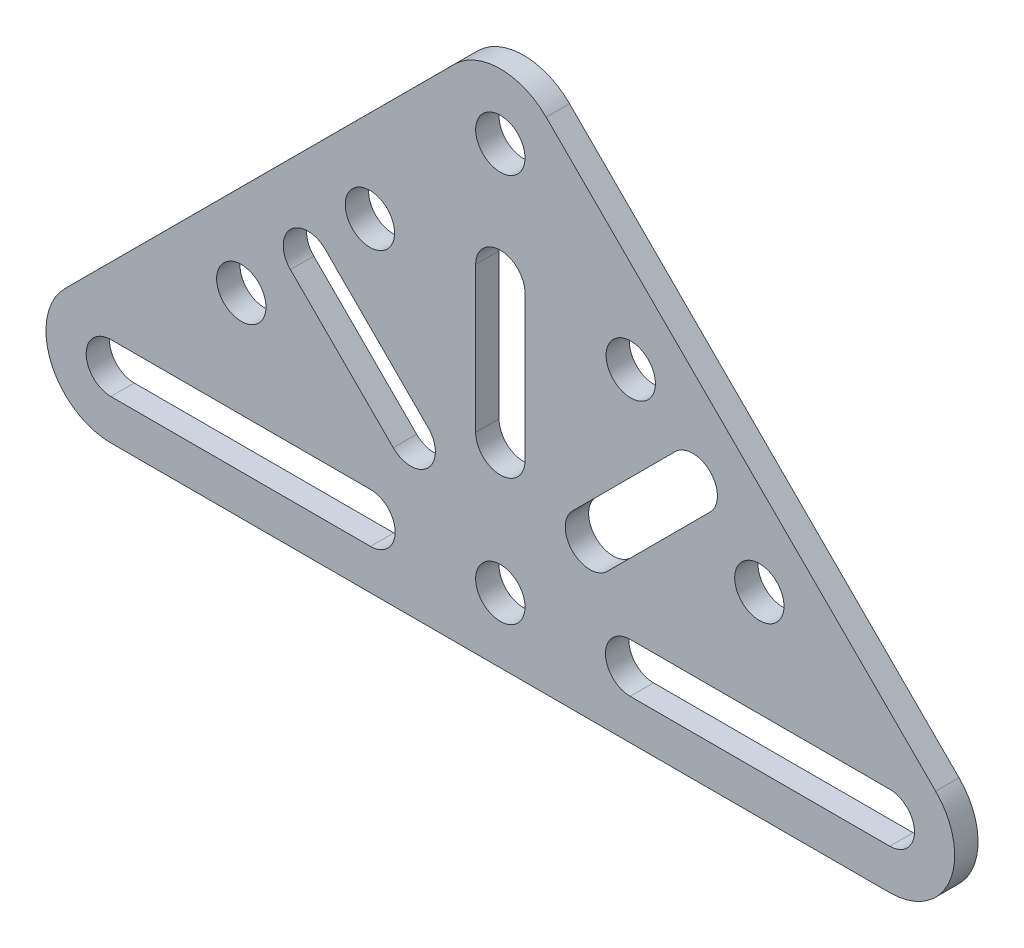
ISO-10303-21;
HEADER;
FILE_DESCRIPTION(('STEP AP214'),'2;1');
FILE_NAME('part.step','',(''),(''),'','','');
FILE_SCHEMA(('AUTOMOTIVE_DESIGN { 1 0 10303 214 1 1 1 1 }'));
ENDSEC;
DATA;
#1=APPLICATION_CONTEXT('core data for automotive mechanical design processes');
#2=APPLICATION_PROTOCOL_DEFINITION('international standard','automotive_design',2000,#1);
#3=PRODUCT_CONTEXT('',#1,'mechanical');
#4=PRODUCT('Part','Part','',(#3));
#5=PRODUCT_RELATED_PRODUCT_CATEGORY('part','',(#4));
#6=PRODUCT_DEFINITION_FORMATION('','',#4);
#7=PRODUCT_DEFINITION_CONTEXT('part definition',#1,'design');
#8=PRODUCT_DEFINITION('design','',#6,#7);
#9=PRODUCT_DEFINITION_SHAPE('','',#8);
#10=(LENGTH_UNIT() NAMED_UNIT(*) SI_UNIT(.MILLI.,.METRE.));
#11=(NAMED_UNIT(*) PLANE_ANGLE_UNIT() SI_UNIT($,.RADIAN.));
#12=(NAMED_UNIT(*) SI_UNIT($,.STERADIAN.) SOLID_ANGLE_UNIT());
#13=UNCERTAINTY_MEASURE_WITH_UNIT(LENGTH_MEASURE(1.E-05),#10,'distance_accuracy_value','');
#14=(GEOMETRIC_REPRESENTATION_CONTEXT(3) GLOBAL_UNCERTAINTY_ASSIGNED_CONTEXT((#13)) GLOBAL_UNIT_ASSIGNED_CONTEXT((#10,
#11,#12)) REPRESENTATION_CONTEXT('',''));
#15=CARTESIAN_POINT('',(0.,0.,0.));
#16=DIRECTION('',(0.,0.,1.));
#17=DIRECTION('',(1.,0.,0.));
#18=AXIS2_PLACEMENT_3D('',#15,#16,#17);
#19=CARTESIAN_POINT('',(38.1,0.,2.286));
#20=DIRECTION('',(0.,0.,-1.));
#21=DIRECTION('',(-1.,0.,0.));
#22=AXIS2_PLACEMENT_3D('',#19,#20,#21);
#23=CYLINDRICAL_SURFACE('',#22,6.35);
#24=CARTESIAN_POINT('',(38.1,0.,0.));
#25=DIRECTION('',(0.,0.,1.));
#26=DIRECTION('',(-1.,0.,0.));
#27=AXIS2_PLACEMENT_3D('',#24,#25,#26);
#28=CIRCLE('',#27,6.35);
#29=CARTESIAN_POINT('',(38.0999999999998,-6.35000000000001,0.));
#30=VERTEX_POINT('',#29);
#31=CARTESIAN_POINT('',(42.5873298500313,4.49292452830199,0.));
#32=VERTEX_POINT('',#31);
#33=EDGE_CURVE('E406',#30,#32,#28,.T.);
#34=ORIENTED_EDGE('',*,*,#33,.T.);
#35=DIRECTION('',(0.,0.,-1.));
#36=VECTOR('',#35,1.);
#37=CARTESIAN_POINT('',(42.5873298500313,4.49292452830199,2.286));
#38=LINE('',#37,#36);
#39=CARTESIAN_POINT('',(42.5873298500313,4.49292452830199,2.286));
#40=VERTEX_POINT('',#39);
#41=EDGE_CURVE('E11',#40,#32,#38,.T.);
#42=ORIENTED_EDGE('',*,*,#41,.F.);
#43=CARTESIAN_POINT('',(38.1,0.,2.286));
#44=DIRECTION('',(0.,0.,1.));
#45=DIRECTION('',(-1.,0.,0.));
#46=AXIS2_PLACEMENT_3D('',#43,#44,#45);
#47=CIRCLE('',#46,6.35);
#48=CARTESIAN_POINT('',(38.0999999999998,-6.35000000000001,2.286));
#49=VERTEX_POINT('',#48);
#50=EDGE_CURVE('E409',#49,#40,#47,.T.);
#51=ORIENTED_EDGE('',*,*,#50,.F.);
#52=DIRECTION('',(0.,0.,-1.));
#53=VECTOR('',#52,1.);
#54=CARTESIAN_POINT('',(38.0999999999998,-6.35000000000001,2.286));
#55=LINE('',#54,#53);
#56=EDGE_CURVE('E423',#49,#30,#55,.T.);
#57=ORIENTED_EDGE('',*,*,#56,.T.);
#58=EDGE_LOOP('',(#34,#42,#51,#57));
#59=FACE_BOUND('',#58,.T.);
#60=ADVANCED_FACE('F36',(#59),#23,.T.);
#61=CARTESIAN_POINT('',(42.5873298500313,4.49292452830199,2.286));
#62=DIRECTION('',(-0.706666118115189,-0.707547169811321,0.));
#63=DIRECTION('',(0.707547169811321,-0.706666118115189,0.));
#64=AXIS2_PLACEMENT_3D('',#61,#62,#63);
#65=PLANE('',#64);
#66=DIRECTION('',(-0.707547169811321,0.706666118115189,0.));
#67=VECTOR('',#66,1.);
#68=CARTESIAN_POINT('',(42.5873298500313,4.49292452830199,0.));
#69=LINE('',#68,#67);
#70=CARTESIAN_POINT('',(4.48732985003148,42.5454816565685,0.));
#71=VERTEX_POINT('',#70);
#72=EDGE_CURVE('E426',#32,#71,#69,.T.);
#73=ORIENTED_EDGE('',*,*,#72,.T.);
#74=DIRECTION('',(0.,0.,-1.));
#75=VECTOR('',#74,1.);
#76=CARTESIAN_POINT('',(4.48732985003148,42.5454816565685,2.286));
#77=LINE('',#76,#75);
#78=CARTESIAN_POINT('',(4.48732985003148,42.5454816565685,2.286));
#79=VERTEX_POINT('',#78);
#80=EDGE_CURVE('E43',#79,#71,#77,.T.);
#81=ORIENTED_EDGE('',*,*,#80,.F.);
#82=DIRECTION('',(-0.707547169811321,0.706666118115189,0.));
#83=VECTOR('',#82,1.);
#84=CARTESIAN_POINT('',(42.5873298500313,4.49292452830199,2.286));
#85=LINE('',#84,#83);
#86=EDGE_CURVE('E412',#40,#79,#85,.T.);
#87=ORIENTED_EDGE('',*,*,#86,.F.);
#88=ORIENTED_EDGE('',*,*,#41,.T.);
#89=EDGE_LOOP('',(#73,#81,#87,#88));
#90=FACE_BOUND('',#89,.T.);
#91=ADVANCED_FACE('F472',(#90),#65,.F.);
#92=CARTESIAN_POINT('',(0.,38.0525571282667,2.286));
#93=DIRECTION('',(0.,0.,-1.));
#94=DIRECTION('',(-1.,0.,0.));
#95=AXIS2_PLACEMENT_3D('',#92,#93,#94);
#96=CYLINDRICAL_SURFACE('',#95,6.35);
#97=CARTESIAN_POINT('',(0.,38.0525571282667,0.));
#98=DIRECTION('',(0.,0.,1.));
#99=DIRECTION('',(-1.,0.,0.));
#100=AXIS2_PLACEMENT_3D('',#97,#98,#99);
#101=CIRCLE('',#100,6.35);
#102=CARTESIAN_POINT('',(-4.48732985003148,42.5454816565685,0.));
#103=VERTEX_POINT('',#102);
#104=EDGE_CURVE('E428',#71,#103,#101,.T.);
#105=ORIENTED_EDGE('',*,*,#104,.T.);
#106=DIRECTION('',(0.,0.,-1.));
#107=VECTOR('',#106,1.);
#108=CARTESIAN_POINT('',(-4.48732985003148,42.5454816565685,2.286));
#109=LINE('',#108,#107);
#110=CARTESIAN_POINT('',(-4.48732985003148,42.5454816565685,2.286));
#111=VERTEX_POINT('',#110);
#112=EDGE_CURVE('E443',#111,#103,#109,.T.);
#113=ORIENTED_EDGE('',*,*,#112,.F.);
#114=CARTESIAN_POINT('',(0.,38.0525571282667,2.286));
#115=DIRECTION('',(0.,0.,1.));
#116=DIRECTION('',(-1.,0.,0.));
#117=AXIS2_PLACEMENT_3D('',#114,#115,#116);
#118=CIRCLE('',#117,6.35);
#119=EDGE_CURVE('E415',#79,#111,#118,.T.);
#120=ORIENTED_EDGE('',*,*,#119,.F.);
#121=ORIENTED_EDGE('',*,*,#80,.T.);
#122=EDGE_LOOP('',(#105,#113,#120,#121));
#123=FACE_BOUND('',#122,.T.);
#124=ADVANCED_FACE('F450',(#123),#96,.T.);
#125=CARTESIAN_POINT('',(-42.5873298500313,4.49292452830199,2.286));
#126=DIRECTION('',(0.706666118115189,-0.707547169811321,0.));
#127=DIRECTION('',(0.707547169811321,0.706666118115189,0.));
#128=AXIS2_PLACEMENT_3D('',#125,#126,#127);
#129=PLANE('',#128);
#130=DIRECTION('',(-0.707547169811321,-0.706666118115189,0.));
#131=VECTOR('',#130,1.);
#132=CARTESIAN_POINT('',(-42.5873298500313,4.49292452830199,0.));
#133=LINE('',#132,#131);
#134=CARTESIAN_POINT('',(-42.5873298500313,4.49292452830199,0.));
#135=VERTEX_POINT('',#134);
#136=EDGE_CURVE('E430',#103,#135,#133,.T.);
#137=ORIENTED_EDGE('',*,*,#136,.T.);
#138=DIRECTION('',(0.,0.,-1.));
#139=VECTOR('',#138,1.);
#140=CARTESIAN_POINT('',(-42.5873298500313,4.49292452830199,2.286));
#141=LINE('',#140,#139);
#142=CARTESIAN_POINT('',(-42.5873298500313,4.49292452830199,2.286));
#143=VERTEX_POINT('',#142);
#144=EDGE_CURVE('E440',#143,#135,#141,.T.);
#145=ORIENTED_EDGE('',*,*,#144,.F.);
#146=DIRECTION('',(-0.707547169811321,-0.706666118115189,0.));
#147=VECTOR('',#146,1.);
#148=CARTESIAN_POINT('',(-42.5873298500313,4.49292452830199,2.286));
#149=LINE('',#148,#147);
#150=EDGE_CURVE('E417',#111,#143,#149,.T.);
#151=ORIENTED_EDGE('',*,*,#150,.F.);
#152=ORIENTED_EDGE('',*,*,#112,.T.);
#153=EDGE_LOOP('',(#137,#145,#151,#152));
#154=FACE_BOUND('',#153,.T.);
#155=ADVANCED_FACE('F460',(#154),#129,.F.);
#156=CARTESIAN_POINT('',(-38.1,0.,2.286));
#157=DIRECTION('',(0.,0.,-1.));
#158=DIRECTION('',(-1.,0.,0.));
#159=AXIS2_PLACEMENT_3D('',#156,#157,#158);
#160=CYLINDRICAL_SURFACE('',#159,6.35);
#161=CARTESIAN_POINT('',(-38.1,0.,0.));
#162=DIRECTION('',(0.,0.,1.));
#163=DIRECTION('',(1.,0.,0.));
#164=AXIS2_PLACEMENT_3D('',#161,#162,#163);
#165=CIRCLE('',#164,6.35);
#166=CARTESIAN_POINT('',(-38.0999999999999,-6.35000000000001,0.));
#167=VERTEX_POINT('',#166);
#168=EDGE_CURVE('E432',#135,#167,#165,.T.);
#169=ORIENTED_EDGE('',*,*,#168,.T.);
#170=DIRECTION('',(0.,0.,-1.));
#171=VECTOR('',#170,1.);
#172=CARTESIAN_POINT('',(-38.0999999999999,-6.35000000000001,2.286));
#173=LINE('',#172,#171);
#174=CARTESIAN_POINT('',(-38.0999999999999,-6.35000000000001,2.286));
#175=VERTEX_POINT('',#174);
#176=EDGE_CURVE('E437',#175,#167,#173,.T.);
#177=ORIENTED_EDGE('',*,*,#176,.F.);
#178=CARTESIAN_POINT('',(-38.1,0.,2.286));
#179=DIRECTION('',(0.,0.,1.));
#180=DIRECTION('',(1.,0.,0.));
#181=AXIS2_PLACEMENT_3D('',#178,#179,#180);
#182=CIRCLE('',#181,6.35);
#183=EDGE_CURVE('E419',#143,#175,#182,.T.);
#184=ORIENTED_EDGE('',*,*,#183,.F.);
#185=ORIENTED_EDGE('',*,*,#144,.T.);
#186=EDGE_LOOP('',(#169,#177,#184,#185));
#187=FACE_BOUND('',#186,.T.);
#188=ADVANCED_FACE('F464',(#187),#160,.T.);
#189=CARTESIAN_POINT('',(38.0999999999998,-6.35000000000001,2.286));
#190=DIRECTION('',(0.,1.,0.));
#191=DIRECTION('',(-1.,0.,0.));
#192=AXIS2_PLACEMENT_3D('',#189,#190,#191);
#193=PLANE('',#192);
#194=DIRECTION('',(1.,0.,0.));
#195=VECTOR('',#194,1.);
#196=CARTESIAN_POINT('',(38.0999999999998,-6.35000000000001,0.));
#197=LINE('',#196,#195);
#198=EDGE_CURVE('E413',#167,#30,#197,.T.);
#199=ORIENTED_EDGE('',*,*,#198,.T.);
#200=ORIENTED_EDGE('',*,*,#56,.F.);
#201=DIRECTION('',(1.,0.,0.));
#202=VECTOR('',#201,1.);
#203=CARTESIAN_POINT('',(38.0999999999998,-6.35000000000001,2.286));
#204=LINE('',#203,#202);
#205=EDGE_CURVE('E421',#175,#49,#204,.T.);
#206=ORIENTED_EDGE('',*,*,#205,.F.);
#207=ORIENTED_EDGE('',*,*,#176,.T.);
#208=EDGE_LOOP('',(#199,#200,#206,#207));
#209=FACE_BOUND('',#208,.T.);
#210=ADVANCED_FACE('F475',(#209),#193,.F.);
#211=CARTESIAN_POINT('',(38.1,0.,2.286));
#212=DIRECTION('',(0.,0.,-1.));
#213=DIRECTION('',(-1.,0.,0.));
#214=AXIS2_PLACEMENT_3D('',#211,#212,#213);
#215=PLANE('',#214);
#216=DIRECTION('',(-0.70710678118655,-0.707106781186545,0.));
#217=VECTOR('',#216,1.);
#218=CARTESIAN_POINT('',(17.1188269258908,20.531324251897,2.286));
#219=LINE('',#218,#217);
#220=CARTESIAN_POINT('',(17.1188269258908,20.531324251897,2.286));
#221=VERTEX_POINT('',#220);
#222=CARTESIAN_POINT('',(7.06094007029334,10.4734373962996,2.286));
#223=VERTEX_POINT('',#222);
#224=EDGE_CURVE('E235',#221,#223,#219,.T.);
#225=ORIENTED_EDGE('',*,*,#224,.F.);
#226=CARTESIAN_POINT('',(18.8250755888939,18.8250755888939,2.286));
#227=DIRECTION('',(0.,0.,1.));
#228=DIRECTION('',(0.,-1.,0.));
#229=AXIS2_PLACEMENT_3D('',#226,#227,#228);
#230=CIRCLE('',#229,2.41299999999999);
#231=CARTESIAN_POINT('',(20.5313242518971,17.1188269258907,2.286));
#232=VERTEX_POINT('',#231);
#233=EDGE_CURVE('E50',#232,#221,#230,.T.);
#234=ORIENTED_EDGE('',*,*,#233,.F.);
#235=DIRECTION('',(0.70710678118655,0.707106781186545,0.));
#236=VECTOR('',#235,1.);
#237=CARTESIAN_POINT('',(20.5313242518971,17.1188269258907,2.286));
#238=LINE('',#237,#236);
#239=CARTESIAN_POINT('',(10.4734373962996,7.06094007029327,2.286));
#240=VERTEX_POINT('',#239);
#241=EDGE_CURVE('E226',#240,#232,#238,.T.);
#242=ORIENTED_EDGE('',*,*,#241,.F.);
#243=CARTESIAN_POINT('',(8.76718873329647,8.76718873329641,2.286));
#244=DIRECTION('',(0.,0.,1.));
#245=DIRECTION('',(0.,-1.,0.));
#246=AXIS2_PLACEMENT_3D('',#243,#244,#245);
#247=CIRCLE('',#246,2.413);
#248=EDGE_CURVE('E229',#223,#240,#247,.T.);
#249=ORIENTED_EDGE('',*,*,#248,.F.);
#250=EDGE_LOOP('',(#225,#234,#242,#249));
#251=FACE_BOUND('',#250,.T.);
#252=DIRECTION('',(0.,-1.,0.));
#253=VECTOR('',#252,1.);
#254=CARTESIAN_POINT('',(-2.41299999999995,26.6226772105124,2.286));
#255=LINE('',#254,#253);
#256=CARTESIAN_POINT('',(-2.41299999999995,26.6226772105124,2.286));
#257=VERTEX_POINT('',#256);
#258=CARTESIAN_POINT('',(-2.41299999999998,12.3986772105124,2.286));
#259=VERTEX_POINT('',#258);
#260=EDGE_CURVE('E260',#257,#259,#255,.T.);
#261=ORIENTED_EDGE('',*,*,#260,.F.);
#262=CARTESIAN_POINT('',(0.,26.6226772105124,2.286));
#263=DIRECTION('',(0.,0.,1.));
#264=DIRECTION('',(0.707106781186546,-0.707106781186549,0.));
#265=AXIS2_PLACEMENT_3D('',#262,#263,#264);
#266=CIRCLE('',#265,2.41299999999999);
#267=CARTESIAN_POINT('',(2.41300000000004,26.6226772105124,2.286));
#268=VERTEX_POINT('',#267);
#269=EDGE_CURVE('E241',#268,#257,#266,.T.);
#270=ORIENTED_EDGE('',*,*,#269,.F.);
#271=DIRECTION('',(0.,1.,0.));
#272=VECTOR('',#271,1.);
#273=CARTESIAN_POINT('',(2.41300000000004,26.6226772105124,2.286));
#274=LINE('',#273,#272);
#275=CARTESIAN_POINT('',(2.41300000000002,12.3986772105124,2.286));
#276=VERTEX_POINT('',#275);
#277=EDGE_CURVE('E249',#276,#268,#274,.T.);
#278=ORIENTED_EDGE('',*,*,#277,.F.);
#279=CARTESIAN_POINT('',(0.,12.3986772105124,2.286));
#280=DIRECTION('',(0.,0.,1.));
#281=DIRECTION('',(0.707106781186546,-0.707106781186549,0.));
#282=AXIS2_PLACEMENT_3D('',#279,#280,#281);
#283=CIRCLE('',#282,2.413);
#284=EDGE_CURVE('E263',#259,#276,#283,.T.);
#285=ORIENTED_EDGE('',*,*,#284,.F.);
#286=EDGE_LOOP('',(#261,#270,#278,#285));
#287=FACE_BOUND('',#286,.T.);
#288=DIRECTION('',(0.707106781186547,-0.707106781186548,0.));
#289=VECTOR('',#288,1.);
#290=CARTESIAN_POINT('',(-20.531324251897,17.1188269258908,2.286));
#291=LINE('',#290,#289);
#292=CARTESIAN_POINT('',(-20.531324251897,17.1188269258908,2.286));
#293=VERTEX_POINT('',#292);
#294=CARTESIAN_POINT('',(-10.4734373962996,7.0609400702933,2.286));
#295=VERTEX_POINT('',#294);
#296=EDGE_CURVE('E292',#293,#295,#291,.T.);
#297=ORIENTED_EDGE('',*,*,#296,.F.);
#298=CARTESIAN_POINT('',(-18.825075588894,18.8250755888938,2.286));
#299=DIRECTION('',(0.,0.,1.));
#300=DIRECTION('',(1.,0.,0.));
#301=AXIS2_PLACEMENT_3D('',#298,#299,#300);
#302=CIRCLE('',#301,2.41299999999999);
#303=CARTESIAN_POINT('',(-17.1188269258908,20.531324251897,2.286));
#304=VERTEX_POINT('',#303);
#305=EDGE_CURVE('E270',#304,#293,#302,.T.);
#306=ORIENTED_EDGE('',*,*,#305,.F.);
#307=DIRECTION('',(-0.707106781186548,0.707106781186547,0.));
#308=VECTOR('',#307,1.);
#309=CARTESIAN_POINT('',(-17.1188269258908,20.531324251897,2.286));
#310=LINE('',#309,#308);
#311=CARTESIAN_POINT('',(-7.0609400702933,10.4734373962996,2.286));
#312=VERTEX_POINT('',#311);
#313=EDGE_CURVE('E281',#312,#304,#310,.T.);
#314=ORIENTED_EDGE('',*,*,#313,.F.);
#315=CARTESIAN_POINT('',(-8.76718873329644,8.76718873329644,2.286));
#316=DIRECTION('',(0.,0.,1.));
#317=DIRECTION('',(1.,0.,0.));
#318=AXIS2_PLACEMENT_3D('',#315,#316,#317);
#319=CIRCLE('',#318,2.413);
#320=EDGE_CURVE('E295',#295,#312,#319,.T.);
#321=ORIENTED_EDGE('',*,*,#320,.F.);
#322=EDGE_LOOP('',(#297,#306,#314,#321));
#323=FACE_BOUND('',#322,.T.);
#324=DIRECTION('',(1.,0.,0.));
#325=VECTOR('',#324,1.);
#326=CARTESIAN_POINT('',(38.1,2.413,2.286));
#327=LINE('',#326,#325);
#328=CARTESIAN_POINT('',(12.7,2.413,2.286));
#329=VERTEX_POINT('',#328);
#330=CARTESIAN_POINT('',(38.1,2.413,2.286));
#331=VERTEX_POINT('',#330);
#332=EDGE_CURVE('E327',#329,#331,#327,.T.);
#333=ORIENTED_EDGE('',*,*,#332,.T.);
#334=CARTESIAN_POINT('',(38.1,0.,2.286));
#335=DIRECTION('',(0.,0.,-1.));
#336=DIRECTION('',(-1.,0.,0.));
#337=AXIS2_PLACEMENT_3D('',#334,#335,#336);
#338=CIRCLE('',#337,2.41300000000001);
#339=CARTESIAN_POINT('',(38.1,-2.41300000000001,2.286));
#340=VERTEX_POINT('',#339);
#341=EDGE_CURVE('E335',#331,#340,#338,.T.);
#342=ORIENTED_EDGE('',*,*,#341,.T.);
#343=DIRECTION('',(-1.,0.,0.));
#344=VECTOR('',#343,1.);
#345=CARTESIAN_POINT('',(38.1,-2.41300000000001,2.286));
#346=LINE('',#345,#344);
#347=CARTESIAN_POINT('',(12.7,-2.41300000000001,2.286));
#348=VERTEX_POINT('',#347);
#349=EDGE_CURVE('E302',#340,#348,#346,.T.);
#350=ORIENTED_EDGE('',*,*,#349,.T.);
#351=CARTESIAN_POINT('',(12.7,0.,2.286));
#352=DIRECTION('',(0.,0.,-1.));
#353=DIRECTION('',(1.,0.,0.));
#354=AXIS2_PLACEMENT_3D('',#351,#352,#353);
#355=CIRCLE('',#354,2.41300000000001);
#356=EDGE_CURVE('E319',#348,#329,#355,.T.);
#357=ORIENTED_EDGE('',*,*,#356,.T.);
#358=EDGE_LOOP('',(#333,#342,#350,#357));
#359=FACE_BOUND('',#358,.T.);
#360=DIRECTION('',(1.,0.,0.));
#361=VECTOR('',#360,1.);
#362=CARTESIAN_POINT('',(-38.1,-2.41300000000001,2.286));
#363=LINE('',#362,#361);
#364=CARTESIAN_POINT('',(-38.1,-2.41300000000001,2.286));
#365=VERTEX_POINT('',#364);
#366=CARTESIAN_POINT('',(-12.7,-2.41300000000001,2.286));
#367=VERTEX_POINT('',#366);
#368=EDGE_CURVE('E356',#365,#367,#363,.T.);
#369=ORIENTED_EDGE('',*,*,#368,.F.);
#370=CARTESIAN_POINT('',(-38.1,0.,2.286));
#371=DIRECTION('',(0.,0.,1.));
#372=DIRECTION('',(1.,0.,0.));
#373=AXIS2_PLACEMENT_3D('',#370,#371,#372);
#374=CIRCLE('',#373,2.41300000000001);
#375=CARTESIAN_POINT('',(-38.1,2.413,2.286));
#376=VERTEX_POINT('',#375);
#377=EDGE_CURVE('E340',#376,#365,#374,.T.);
#378=ORIENTED_EDGE('',*,*,#377,.F.);
#379=DIRECTION('',(-1.,0.,0.));
#380=VECTOR('',#379,1.);
#381=CARTESIAN_POINT('',(-38.1,2.413,2.286));
#382=LINE('',#381,#380);
#383=CARTESIAN_POINT('',(-12.7,2.413,2.286));
#384=VERTEX_POINT('',#383);
#385=EDGE_CURVE('E345',#384,#376,#382,.T.);
#386=ORIENTED_EDGE('',*,*,#385,.F.);
#387=CARTESIAN_POINT('',(-12.7,0.,2.286));
#388=DIRECTION('',(0.,0.,1.));
#389=DIRECTION('',(-1.,0.,0.));
#390=AXIS2_PLACEMENT_3D('',#387,#388,#389);
#391=CIRCLE('',#390,2.41300000000001);
#392=EDGE_CURVE('E359',#367,#384,#391,.T.);
#393=ORIENTED_EDGE('',*,*,#392,.F.);
#394=EDGE_LOOP('',(#369,#378,#386,#393));
#395=FACE_BOUND('',#394,.T.);
#396=CARTESIAN_POINT('',(12.7599056603774,25.3085403541774,2.286));
#397=DIRECTION('',(0.,0.,1.));
#398=DIRECTION('',(-1.,0.,0.));
#399=AXIS2_PLACEMENT_3D('',#396,#397,#398);
#400=CIRCLE('',#399,2.413);
#401=CARTESIAN_POINT('',(10.3469056603774,25.3085403541774,2.286));
#402=VERTEX_POINT('',#401);
#403=EDGE_CURVE('E366',#402,#402,#400,.T.);
#404=ORIENTED_EDGE('',*,*,#403,.F.);
#405=EDGE_LOOP('',(#404));
#406=FACE_BOUND('',#405,.T.);
#407=CARTESIAN_POINT('',(-12.7599056603774,25.3085403541774,2.286));
#408=DIRECTION('',(0.,0.,1.));
#409=DIRECTION('',(1.,0.,0.));
#410=AXIS2_PLACEMENT_3D('',#407,#408,#409);
#411=CIRCLE('',#410,2.413);
#412=CARTESIAN_POINT('',(-10.3469056603774,25.3085403541774,2.286));
#413=VERTEX_POINT('',#412);
#414=EDGE_CURVE('E383',#413,#413,#411,.T.);
#415=ORIENTED_EDGE('',*,*,#414,.F.);
#416=EDGE_LOOP('',(#415));
#417=FACE_BOUND('',#416,.T.);
#418=CARTESIAN_POINT('',(25.3400943396226,12.7440167740893,2.286));
#419=DIRECTION('',(0.,0.,1.));
#420=DIRECTION('',(-1.,0.,0.));
#421=AXIS2_PLACEMENT_3D('',#418,#419,#420);
#422=CIRCLE('',#421,2.41299999999999);
#423=CARTESIAN_POINT('',(22.9270943396227,12.7440167740893,2.286));
#424=VERTEX_POINT('',#423);
#425=EDGE_CURVE('E377',#424,#424,#422,.T.);
#426=ORIENTED_EDGE('',*,*,#425,.F.);
#427=EDGE_LOOP('',(#426));
#428=FACE_BOUND('',#427,.T.);
#429=CARTESIAN_POINT('',(-25.3400943396226,12.7440167740893,2.286));
#430=DIRECTION('',(0.,0.,1.));
#431=DIRECTION('',(1.,0.,0.));
#432=AXIS2_PLACEMENT_3D('',#429,#430,#431);
#433=CIRCLE('',#432,2.413);
#434=CARTESIAN_POINT('',(-22.9270943396226,12.7440167740893,2.286));
#435=VERTEX_POINT('',#434);
#436=EDGE_CURVE('E376',#435,#435,#433,.T.);
#437=ORIENTED_EDGE('',*,*,#436,.F.);
#438=EDGE_LOOP('',(#437));
#439=FACE_BOUND('',#438,.T.);
#440=CARTESIAN_POINT('',(0.,38.0525571282667,2.286));
#441=DIRECTION('',(0.,0.,1.));
#442=DIRECTION('',(1.,0.,0.));
#443=AXIS2_PLACEMENT_3D('',#440,#441,#442);
#444=CIRCLE('',#443,2.413);
#445=CARTESIAN_POINT('',(2.413,38.0525571282667,2.286));
#446=VERTEX_POINT('',#445);
#447=EDGE_CURVE('E395',#446,#446,#444,.T.);
#448=ORIENTED_EDGE('',*,*,#447,.F.);
#449=EDGE_LOOP('',(#448));
#450=FACE_BOUND('',#449,.T.);
#451=CARTESIAN_POINT('',(0.,0.,2.286));
#452=DIRECTION('',(0.,0.,1.));
#453=DIRECTION('',(1.,0.,0.));
#454=AXIS2_PLACEMENT_3D('',#451,#452,#453);
#455=CIRCLE('',#454,2.413);
#456=CARTESIAN_POINT('',(2.413,0.,2.286));
#457=VERTEX_POINT('',#456);
#458=EDGE_CURVE('E394',#457,#457,#455,.T.);
#459=ORIENTED_EDGE('',*,*,#458,.F.);
#460=EDGE_LOOP('',(#459));
#461=FACE_BOUND('',#460,.T.);
#462=ORIENTED_EDGE('',*,*,#50,.T.);
#463=ORIENTED_EDGE('',*,*,#86,.T.);
#464=ORIENTED_EDGE('',*,*,#119,.T.);
#465=ORIENTED_EDGE('',*,*,#150,.T.);
#466=ORIENTED_EDGE('',*,*,#183,.T.);
#467=ORIENTED_EDGE('',*,*,#205,.T.);
#468=EDGE_LOOP('',(#462,#463,#464,#465,#466,#467));
#469=FACE_BOUND('',#468,.T.);
#470=ADVANCED_FACE('F468',(#251,#287,#323,#359,#395,#406,#417,#428,#439,#450,#461,#469),#215,.F.);
#471=CARTESIAN_POINT('',(38.1,0.,0.));
#472=DIRECTION('',(0.,0.,-1.));
#473=DIRECTION('',(-1.,0.,0.));
#474=AXIS2_PLACEMENT_3D('',#471,#472,#473);
#475=PLANE('',#474);
#476=CARTESIAN_POINT('',(18.8250755888939,18.8250755888939,0.));
#477=DIRECTION('',(0.,0.,1.));
#478=DIRECTION('',(0.,-1.,0.));
#479=AXIS2_PLACEMENT_3D('',#476,#477,#478);
#480=CIRCLE('',#479,2.41299999999999);
#481=CARTESIAN_POINT('',(20.5313242518971,17.1188269258907,0.));
#482=VERTEX_POINT('',#481);
#483=CARTESIAN_POINT('',(17.1188269258908,20.531324251897,0.));
#484=VERTEX_POINT('',#483);
#485=EDGE_CURVE('E210',#482,#484,#480,.T.);
#486=ORIENTED_EDGE('',*,*,#485,.T.);
#487=DIRECTION('',(-0.70710678118655,-0.707106781186545,0.));
#488=VECTOR('',#487,1.);
#489=CARTESIAN_POINT('',(17.1188269258908,20.531324251897,0.));
#490=LINE('',#489,#488);
#491=CARTESIAN_POINT('',(7.06094007029334,10.4734373962996,0.));
#492=VERTEX_POINT('',#491);
#493=EDGE_CURVE('E219',#484,#492,#490,.T.);
#494=ORIENTED_EDGE('',*,*,#493,.T.);
#495=CARTESIAN_POINT('',(8.76718873329647,8.76718873329641,0.));
#496=DIRECTION('',(0.,0.,1.));
#497=DIRECTION('',(0.,-1.,0.));
#498=AXIS2_PLACEMENT_3D('',#495,#496,#497);
#499=CIRCLE('',#498,2.413);
#500=CARTESIAN_POINT('',(10.4734373962996,7.06094007029327,0.));
#501=VERTEX_POINT('',#500);
#502=EDGE_CURVE('E58',#492,#501,#499,.T.);
#503=ORIENTED_EDGE('',*,*,#502,.T.);
#504=DIRECTION('',(0.70710678118655,0.707106781186545,0.));
#505=VECTOR('',#504,1.);
#506=CARTESIAN_POINT('',(20.5313242518971,17.1188269258907,0.));
#507=LINE('',#506,#505);
#508=EDGE_CURVE('E216',#501,#482,#507,.T.);
#509=ORIENTED_EDGE('',*,*,#508,.T.);
#510=EDGE_LOOP('',(#486,#494,#503,#509));
#511=FACE_BOUND('',#510,.T.);
#512=CARTESIAN_POINT('',(0.,26.6226772105124,0.));
#513=DIRECTION('',(0.,0.,1.));
#514=DIRECTION('',(0.707106781186546,-0.707106781186549,0.));
#515=AXIS2_PLACEMENT_3D('',#512,#513,#514);
#516=CIRCLE('',#515,2.41299999999999);
#517=CARTESIAN_POINT('',(2.41300000000004,26.6226772105124,0.));
#518=VERTEX_POINT('',#517);
#519=CARTESIAN_POINT('',(-2.41299999999995,26.6226772105124,0.));
#520=VERTEX_POINT('',#519);
#521=EDGE_CURVE('E245',#518,#520,#516,.T.);
#522=ORIENTED_EDGE('',*,*,#521,.T.);
#523=DIRECTION('',(0.,-1.,0.));
#524=VECTOR('',#523,1.);
#525=CARTESIAN_POINT('',(-2.41299999999995,26.6226772105124,0.));
#526=LINE('',#525,#524);
#527=CARTESIAN_POINT('',(-2.41299999999998,12.3986772105124,0.));
#528=VERTEX_POINT('',#527);
#529=EDGE_CURVE('E248',#520,#528,#526,.T.);
#530=ORIENTED_EDGE('',*,*,#529,.T.);
#531=CARTESIAN_POINT('',(0.,12.3986772105124,0.));
#532=DIRECTION('',(0.,0.,1.));
#533=DIRECTION('',(0.707106781186546,-0.707106781186549,0.));
#534=AXIS2_PLACEMENT_3D('',#531,#532,#533);
#535=CIRCLE('',#534,2.413);
#536=CARTESIAN_POINT('',(2.41300000000002,12.3986772105124,0.));
#537=VERTEX_POINT('',#536);
#538=EDGE_CURVE('E252',#528,#537,#535,.T.);
#539=ORIENTED_EDGE('',*,*,#538,.T.);
#540=DIRECTION('',(0.,1.,0.));
#541=VECTOR('',#540,1.);
#542=CARTESIAN_POINT('',(2.41300000000004,26.6226772105124,0.));
#543=LINE('',#542,#541);
#544=EDGE_CURVE('E255',#537,#518,#543,.T.);
#545=ORIENTED_EDGE('',*,*,#544,.T.);
#546=EDGE_LOOP('',(#522,#530,#539,#545));
#547=FACE_BOUND('',#546,.T.);
#548=CARTESIAN_POINT('',(-18.825075588894,18.8250755888938,0.));
#549=DIRECTION('',(0.,0.,1.));
#550=DIRECTION('',(1.,0.,0.));
#551=AXIS2_PLACEMENT_3D('',#548,#549,#550);
#552=CIRCLE('',#551,2.41299999999999);
#553=CARTESIAN_POINT('',(-17.1188269258908,20.531324251897,0.));
#554=VERTEX_POINT('',#553);
#555=CARTESIAN_POINT('',(-20.531324251897,17.1188269258908,0.));
#556=VERTEX_POINT('',#555);
#557=EDGE_CURVE('E277',#554,#556,#552,.T.);
#558=ORIENTED_EDGE('',*,*,#557,.T.);
#559=DIRECTION('',(0.707106781186547,-0.707106781186548,0.));
#560=VECTOR('',#559,1.);
#561=CARTESIAN_POINT('',(-20.531324251897,17.1188269258908,0.));
#562=LINE('',#561,#560);
#563=CARTESIAN_POINT('',(-10.4734373962996,7.0609400702933,0.));
#564=VERTEX_POINT('',#563);
#565=EDGE_CURVE('E280',#556,#564,#562,.T.);
#566=ORIENTED_EDGE('',*,*,#565,.T.);
#567=CARTESIAN_POINT('',(-8.76718873329644,8.76718873329644,0.));
#568=DIRECTION('',(0.,0.,1.));
#569=DIRECTION('',(1.,0.,0.));
#570=AXIS2_PLACEMENT_3D('',#567,#568,#569);
#571=CIRCLE('',#570,2.413);
#572=CARTESIAN_POINT('',(-7.0609400702933,10.4734373962996,0.));
#573=VERTEX_POINT('',#572);
#574=EDGE_CURVE('E284',#564,#573,#571,.T.);
#575=ORIENTED_EDGE('',*,*,#574,.T.);
#576=DIRECTION('',(-0.707106781186548,0.707106781186547,0.));
#577=VECTOR('',#576,1.);
#578=CARTESIAN_POINT('',(-17.1188269258908,20.531324251897,0.));
#579=LINE('',#578,#577);
#580=EDGE_CURVE('E287',#573,#554,#579,.T.);
#581=ORIENTED_EDGE('',*,*,#580,.T.);
#582=EDGE_LOOP('',(#558,#566,#575,#581));
#583=FACE_BOUND('',#582,.T.);
#584=CARTESIAN_POINT('',(38.1,0.,0.));
#585=DIRECTION('',(0.,0.,-1.));
#586=DIRECTION('',(-1.,0.,0.));
#587=AXIS2_PLACEMENT_3D('',#584,#585,#586);
#588=CIRCLE('',#587,2.41300000000001);
#589=CARTESIAN_POINT('',(38.1,2.413,0.));
#590=VERTEX_POINT('',#589);
#591=CARTESIAN_POINT('',(38.1,-2.41300000000001,0.));
#592=VERTEX_POINT('',#591);
#593=EDGE_CURVE('E338',#590,#592,#588,.T.);
#594=ORIENTED_EDGE('',*,*,#593,.F.);
#595=DIRECTION('',(1.,0.,0.));
#596=VECTOR('',#595,1.);
#597=CARTESIAN_POINT('',(38.1,2.413,0.));
#598=LINE('',#597,#596);
#599=CARTESIAN_POINT('',(12.7,2.413,0.));
#600=VERTEX_POINT('',#599);
#601=EDGE_CURVE('E332',#600,#590,#598,.T.);
#602=ORIENTED_EDGE('',*,*,#601,.F.);
#603=CARTESIAN_POINT('',(12.7,0.,0.));
#604=DIRECTION('',(0.,0.,-1.));
#605=DIRECTION('',(1.,0.,0.));
#606=AXIS2_PLACEMENT_3D('',#603,#604,#605);
#607=CIRCLE('',#606,2.41300000000001);
#608=CARTESIAN_POINT('',(12.7,-2.41300000000001,0.));
#609=VERTEX_POINT('',#608);
#610=EDGE_CURVE('E324',#609,#600,#607,.T.);
#611=ORIENTED_EDGE('',*,*,#610,.F.);
#612=DIRECTION('',(-1.,0.,0.));
#613=VECTOR('',#612,1.);
#614=CARTESIAN_POINT('',(38.1,-2.41300000000001,0.));
#615=LINE('',#614,#613);
#616=EDGE_CURVE('E311',#592,#609,#615,.T.);
#617=ORIENTED_EDGE('',*,*,#616,.F.);
#618=EDGE_LOOP('',(#594,#602,#611,#617));
#619=FACE_BOUND('',#618,.T.);
#620=CARTESIAN_POINT('',(-38.1,0.,0.));
#621=DIRECTION('',(0.,0.,1.));
#622=DIRECTION('',(1.,0.,0.));
#623=AXIS2_PLACEMENT_3D('',#620,#621,#622);
#624=CIRCLE('',#623,2.41300000000001);
#625=CARTESIAN_POINT('',(-38.1,2.413,0.));
#626=VERTEX_POINT('',#625);
#627=CARTESIAN_POINT('',(-38.1,-2.41300000000001,0.));
#628=VERTEX_POINT('',#627);
#629=EDGE_CURVE('E341',#626,#628,#624,.T.);
#630=ORIENTED_EDGE('',*,*,#629,.T.);
#631=DIRECTION('',(1.,0.,0.));
#632=VECTOR('',#631,1.);
#633=CARTESIAN_POINT('',(-38.1,-2.41300000000001,0.));
#634=LINE('',#633,#632);
#635=CARTESIAN_POINT('',(-12.7,-2.41300000000001,0.));
#636=VERTEX_POINT('',#635);
#637=EDGE_CURVE('E344',#628,#636,#634,.T.);
#638=ORIENTED_EDGE('',*,*,#637,.T.);
#639=CARTESIAN_POINT('',(-12.7,0.,0.));
#640=DIRECTION('',(0.,0.,1.));
#641=DIRECTION('',(-1.,0.,0.));
#642=AXIS2_PLACEMENT_3D('',#639,#640,#641);
#643=CIRCLE('',#642,2.41300000000001);
#644=CARTESIAN_POINT('',(-12.7,2.413,0.));
#645=VERTEX_POINT('',#644);
#646=EDGE_CURVE('E348',#636,#645,#643,.T.);
#647=ORIENTED_EDGE('',*,*,#646,.T.);
#648=DIRECTION('',(-1.,0.,0.));
#649=VECTOR('',#648,1.);
#650=CARTESIAN_POINT('',(-38.1,2.413,0.));
#651=LINE('',#650,#649);
#652=EDGE_CURVE('E351',#645,#626,#651,.T.);
#653=ORIENTED_EDGE('',*,*,#652,.T.);
#654=EDGE_LOOP('',(#630,#638,#647,#653));
#655=FACE_BOUND('',#654,.T.);
#656=CARTESIAN_POINT('',(12.7599056603774,25.3085403541774,0.));
#657=DIRECTION('',(0.,0.,1.));
#658=DIRECTION('',(-1.,0.,0.));
#659=AXIS2_PLACEMENT_3D('',#656,#657,#658);
#660=CIRCLE('',#659,2.413);
#661=CARTESIAN_POINT('',(10.3469056603774,25.3085403541774,0.));
#662=VERTEX_POINT('',#661);
#663=EDGE_CURVE('E386',#662,#662,#660,.T.);
#664=ORIENTED_EDGE('',*,*,#663,.T.);
#665=EDGE_LOOP('',(#664));
#666=FACE_BOUND('',#665,.T.);
#667=CARTESIAN_POINT('',(-12.7599056603774,25.3085403541774,0.));
#668=DIRECTION('',(0.,0.,1.));
#669=DIRECTION('',(1.,0.,0.));
#670=AXIS2_PLACEMENT_3D('',#667,#668,#669);
#671=CIRCLE('',#670,2.413);
#672=CARTESIAN_POINT('',(-10.3469056603774,25.3085403541774,0.));
#673=VERTEX_POINT('',#672);
#674=EDGE_CURVE('E380',#673,#673,#671,.T.);
#675=ORIENTED_EDGE('',*,*,#674,.T.);
#676=EDGE_LOOP('',(#675));
#677=FACE_BOUND('',#676,.T.);
#678=CARTESIAN_POINT('',(25.3400943396226,12.7440167740893,0.));
#679=DIRECTION('',(0.,0.,1.));
#680=DIRECTION('',(-1.,0.,0.));
#681=AXIS2_PLACEMENT_3D('',#678,#679,#680);
#682=CIRCLE('',#681,2.41299999999999);
#683=CARTESIAN_POINT('',(22.9270943396227,12.7440167740893,0.));
#684=VERTEX_POINT('',#683);
#685=EDGE_CURVE('E373',#684,#684,#682,.T.);
#686=ORIENTED_EDGE('',*,*,#685,.T.);
#687=EDGE_LOOP('',(#686));
#688=FACE_BOUND('',#687,.T.);
#689=CARTESIAN_POINT('',(-25.3400943396226,12.7440167740893,0.));
#690=DIRECTION('',(0.,0.,1.));
#691=DIRECTION('',(1.,0.,0.));
#692=AXIS2_PLACEMENT_3D('',#689,#690,#691);
#693=CIRCLE('',#692,2.413);
#694=CARTESIAN_POINT('',(-22.9270943396226,12.7440167740893,0.));
#695=VERTEX_POINT('',#694);
#696=EDGE_CURVE('E398',#695,#695,#693,.T.);
#697=ORIENTED_EDGE('',*,*,#696,.T.);
#698=EDGE_LOOP('',(#697));
#699=FACE_BOUND('',#698,.T.);
#700=CARTESIAN_POINT('',(0.,38.0525571282667,0.));
#701=DIRECTION('',(0.,0.,1.));
#702=DIRECTION('',(1.,0.,0.));
#703=AXIS2_PLACEMENT_3D('',#700,#701,#702);
#704=CIRCLE('',#703,2.413);
#705=CARTESIAN_POINT('',(2.413,38.0525571282667,0.));
#706=VERTEX_POINT('',#705);
#707=EDGE_CURVE('E391',#706,#706,#704,.T.);
#708=ORIENTED_EDGE('',*,*,#707,.T.);
#709=EDGE_LOOP('',(#708));
#710=FACE_BOUND('',#709,.T.);
#711=CARTESIAN_POINT('',(0.,0.,0.));
#712=DIRECTION('',(0.,0.,1.));
#713=DIRECTION('',(1.,0.,0.));
#714=AXIS2_PLACEMENT_3D('',#711,#712,#713);
#715=CIRCLE('',#714,2.413);
#716=CARTESIAN_POINT('',(2.413,0.,0.));
#717=VERTEX_POINT('',#716);
#718=EDGE_CURVE('E403',#717,#717,#715,.T.);
#719=ORIENTED_EDGE('',*,*,#718,.T.);
#720=EDGE_LOOP('',(#719));
#721=FACE_BOUND('',#720,.T.);
#722=ORIENTED_EDGE('',*,*,#33,.F.);
#723=ORIENTED_EDGE('',*,*,#198,.F.);
#724=ORIENTED_EDGE('',*,*,#168,.F.);
#725=ORIENTED_EDGE('',*,*,#136,.F.);
#726=ORIENTED_EDGE('',*,*,#104,.F.);
#727=ORIENTED_EDGE('',*,*,#72,.F.);
#728=EDGE_LOOP('',(#722,#723,#724,#725,#726,#727));
#729=FACE_BOUND('',#728,.T.);
#730=ADVANCED_FACE('F223',(#511,#547,#583,#619,#655,#666,#677,#688,#699,#710,#721,#729),#475,.T.);
#731=CARTESIAN_POINT('',(0.,0.,0.));
#732=DIRECTION('',(0.,0.,1.));
#733=DIRECTION('',(1.,0.,0.));
#734=AXIS2_PLACEMENT_3D('',#731,#732,#733);
#735=CYLINDRICAL_SURFACE('',#734,2.413);
#736=ORIENTED_EDGE('',*,*,#718,.F.);
#737=EDGE_LOOP('',(#736));
#738=FACE_BOUND('',#737,.T.);
#739=ORIENTED_EDGE('',*,*,#458,.T.);
#740=EDGE_LOOP('',(#739));
#741=FACE_BOUND('',#740,.T.);
#742=ADVANCED_FACE('F515',(#738,#741),#735,.F.);
#743=CARTESIAN_POINT('',(0.,38.0525571282667,0.));
#744=DIRECTION('',(0.,0.,1.));
#745=DIRECTION('',(1.,0.,0.));
#746=AXIS2_PLACEMENT_3D('',#743,#744,#745);
#747=CYLINDRICAL_SURFACE('',#746,2.413);
#748=ORIENTED_EDGE('',*,*,#707,.F.);
#749=EDGE_LOOP('',(#748));
#750=FACE_BOUND('',#749,.T.);
#751=ORIENTED_EDGE('',*,*,#447,.T.);
#752=EDGE_LOOP('',(#751));
#753=FACE_BOUND('',#752,.T.);
#754=ADVANCED_FACE('F520',(#750,#753),#747,.F.);
#755=CARTESIAN_POINT('',(-25.3400943396226,12.7440167740893,0.));
#756=DIRECTION('',(0.,0.,1.));
#757=DIRECTION('',(1.,0.,0.));
#758=AXIS2_PLACEMENT_3D('',#755,#756,#757);
#759=CYLINDRICAL_SURFACE('',#758,2.413);
#760=ORIENTED_EDGE('',*,*,#696,.F.);
#761=EDGE_LOOP('',(#760));
#762=FACE_BOUND('',#761,.T.);
#763=ORIENTED_EDGE('',*,*,#436,.T.);
#764=EDGE_LOOP('',(#763));
#765=FACE_BOUND('',#764,.T.);
#766=ADVANCED_FACE('F532',(#762,#765),#759,.F.);
#767=CARTESIAN_POINT('',(25.3400943396226,12.7440167740893,0.));
#768=DIRECTION('',(0.,0.,1.));
#769=DIRECTION('',(1.,0.,0.));
#770=AXIS2_PLACEMENT_3D('',#767,#768,#769);
#771=CYLINDRICAL_SURFACE('',#770,2.41299999999999);
#772=ORIENTED_EDGE('',*,*,#685,.F.);
#773=EDGE_LOOP('',(#772));
#774=FACE_BOUND('',#773,.T.);
#775=ORIENTED_EDGE('',*,*,#425,.T.);
#776=EDGE_LOOP('',(#775));
#777=FACE_BOUND('',#776,.T.);
#778=ADVANCED_FACE('F542',(#774,#777),#771,.F.);
#779=CARTESIAN_POINT('',(-12.7599056603774,25.3085403541774,0.));
#780=DIRECTION('',(0.,0.,1.));
#781=DIRECTION('',(1.,0.,0.));
#782=AXIS2_PLACEMENT_3D('',#779,#780,#781);
#783=CYLINDRICAL_SURFACE('',#782,2.413);
#784=ORIENTED_EDGE('',*,*,#674,.F.);
#785=EDGE_LOOP('',(#784));
#786=FACE_BOUND('',#785,.T.);
#787=ORIENTED_EDGE('',*,*,#414,.T.);
#788=EDGE_LOOP('',(#787));
#789=FACE_BOUND('',#788,.T.);
#790=ADVANCED_FACE('F552',(#786,#789),#783,.F.);
#791=CARTESIAN_POINT('',(12.7599056603774,25.3085403541774,0.));
#792=DIRECTION('',(0.,0.,1.));
#793=DIRECTION('',(1.,0.,0.));
#794=AXIS2_PLACEMENT_3D('',#791,#792,#793);
#795=CYLINDRICAL_SURFACE('',#794,2.413);
#796=ORIENTED_EDGE('',*,*,#663,.F.);
#797=EDGE_LOOP('',(#796));
#798=FACE_BOUND('',#797,.T.);
#799=ORIENTED_EDGE('',*,*,#403,.T.);
#800=EDGE_LOOP('',(#799));
#801=FACE_BOUND('',#800,.T.);
#802=ADVANCED_FACE('F562',(#798,#801),#795,.F.);
#803=CARTESIAN_POINT('',(-38.1,0.,0.));
#804=DIRECTION('',(0.,0.,1.));
#805=DIRECTION('',(1.,0.,0.));
#806=AXIS2_PLACEMENT_3D('',#803,#804,#805);
#807=CYLINDRICAL_SURFACE('',#806,2.41300000000001);
#808=ORIENTED_EDGE('',*,*,#377,.T.);
#809=DIRECTION('',(0.,0.,1.));
#810=VECTOR('',#809,1.);
#811=CARTESIAN_POINT('',(-38.1,-2.41300000000001,0.));
#812=LINE('',#811,#810);
#813=EDGE_CURVE('E354',#628,#365,#812,.T.);
#814=ORIENTED_EDGE('',*,*,#813,.F.);
#815=ORIENTED_EDGE('',*,*,#629,.F.);
#816=DIRECTION('',(0.,0.,1.));
#817=VECTOR('',#816,1.);
#818=CARTESIAN_POINT('',(-38.1,2.413,0.));
#819=LINE('',#818,#817);
#820=EDGE_CURVE('E364',#626,#376,#819,.T.);
#821=ORIENTED_EDGE('',*,*,#820,.T.);
#822=EDGE_LOOP('',(#808,#814,#815,#821));
#823=FACE_BOUND('',#822,.T.);
#824=ADVANCED_FACE('F572',(#823),#807,.F.);
#825=CARTESIAN_POINT('',(-38.1,2.413,0.));
#826=DIRECTION('',(0.,1.,0.));
#827=DIRECTION('',(-1.,0.,0.));
#828=AXIS2_PLACEMENT_3D('',#825,#826,#827);
#829=PLANE('',#828);
#830=ORIENTED_EDGE('',*,*,#385,.T.);
#831=ORIENTED_EDGE('',*,*,#820,.F.);
#832=ORIENTED_EDGE('',*,*,#652,.F.);
#833=DIRECTION('',(0.,0.,1.));
#834=VECTOR('',#833,1.);
#835=CARTESIAN_POINT('',(-12.7,2.413,0.));
#836=LINE('',#835,#834);
#837=EDGE_CURVE('E367',#645,#384,#836,.T.);
#838=ORIENTED_EDGE('',*,*,#837,.T.);
#839=EDGE_LOOP('',(#830,#831,#832,#838));
#840=FACE_BOUND('',#839,.T.);
#841=ADVANCED_FACE('F582',(#840),#829,.F.);
#842=CARTESIAN_POINT('',(-12.7,0.,0.));
#843=DIRECTION('',(0.,0.,1.));
#844=DIRECTION('',(1.,0.,0.));
#845=AXIS2_PLACEMENT_3D('',#842,#843,#844);
#846=CYLINDRICAL_SURFACE('',#845,2.41300000000001);
#847=ORIENTED_EDGE('',*,*,#392,.T.);
#848=ORIENTED_EDGE('',*,*,#837,.F.);
#849=ORIENTED_EDGE('',*,*,#646,.F.);
#850=DIRECTION('',(0.,0.,1.));
#851=VECTOR('',#850,1.);
#852=CARTESIAN_POINT('',(-12.7,-2.41300000000001,0.));
#853=LINE('',#852,#851);
#854=EDGE_CURVE('E369',#636,#367,#853,.T.);
#855=ORIENTED_EDGE('',*,*,#854,.T.);
#856=EDGE_LOOP('',(#847,#848,#849,#855));
#857=FACE_BOUND('',#856,.T.);
#858=ADVANCED_FACE('F592',(#857),#846,.F.);
#859=CARTESIAN_POINT('',(-38.1,-2.41300000000001,0.));
#860=DIRECTION('',(0.,-1.,0.));
#861=DIRECTION('',(0.,0.,-1.));
#862=AXIS2_PLACEMENT_3D('',#859,#860,#861);
#863=PLANE('',#862);
#864=ORIENTED_EDGE('',*,*,#368,.T.);
#865=ORIENTED_EDGE('',*,*,#854,.F.);
#866=ORIENTED_EDGE('',*,*,#637,.F.);
#867=ORIENTED_EDGE('',*,*,#813,.T.);
#868=EDGE_LOOP('',(#864,#865,#866,#867));
#869=FACE_BOUND('',#868,.T.);
#870=ADVANCED_FACE('F602',(#869),#863,.F.);
#871=CARTESIAN_POINT('',(38.1,0.,0.));
#872=DIRECTION('',(0.,0.,1.));
#873=DIRECTION('',(-1.,0.,0.));
#874=AXIS2_PLACEMENT_3D('',#871,#872,#873);
#875=CYLINDRICAL_SURFACE('',#874,2.41300000000001);
#876=ORIENTED_EDGE('',*,*,#341,.F.);
#877=DIRECTION('',(0.,0.,1.));
#878=VECTOR('',#877,1.);
#879=CARTESIAN_POINT('',(38.1,2.413,0.));
#880=LINE('',#879,#878);
#881=EDGE_CURVE('E330',#590,#331,#880,.T.);
#882=ORIENTED_EDGE('',*,*,#881,.F.);
#883=ORIENTED_EDGE('',*,*,#593,.T.);
#884=DIRECTION('',(0.,0.,1.));
#885=VECTOR('',#884,1.);
#886=CARTESIAN_POINT('',(38.1,-2.41300000000001,0.));
#887=LINE('',#886,#885);
#888=EDGE_CURVE('E317',#592,#340,#887,.T.);
#889=ORIENTED_EDGE('',*,*,#888,.T.);
#890=EDGE_LOOP('',(#876,#882,#883,#889));
#891=FACE_BOUND('',#890,.T.);
#892=ADVANCED_FACE('F612',(#891),#875,.F.);
#893=CARTESIAN_POINT('',(38.1,2.413,0.));
#894=DIRECTION('',(0.,1.,0.));
#895=DIRECTION('',(1.,0.,0.));
#896=AXIS2_PLACEMENT_3D('',#893,#894,#895);
#897=PLANE('',#896);
#898=ORIENTED_EDGE('',*,*,#332,.F.);
#899=DIRECTION('',(0.,0.,1.));
#900=VECTOR('',#899,1.);
#901=CARTESIAN_POINT('',(12.7,2.413,0.));
#902=LINE('',#901,#900);
#903=EDGE_CURVE('E322',#600,#329,#902,.T.);
#904=ORIENTED_EDGE('',*,*,#903,.F.);
#905=ORIENTED_EDGE('',*,*,#601,.T.);
#906=ORIENTED_EDGE('',*,*,#881,.T.);
#907=EDGE_LOOP('',(#898,#904,#905,#906));
#908=FACE_BOUND('',#907,.T.);
#909=ADVANCED_FACE('F622',(#908),#897,.F.);
#910=CARTESIAN_POINT('',(12.7,0.,0.));
#911=DIRECTION('',(0.,0.,1.));
#912=DIRECTION('',(-1.,0.,0.));
#913=AXIS2_PLACEMENT_3D('',#910,#911,#912);
#914=CYLINDRICAL_SURFACE('',#913,2.41300000000001);
#915=ORIENTED_EDGE('',*,*,#356,.F.);
#916=DIRECTION('',(0.,0.,1.));
#917=VECTOR('',#916,1.);
#918=CARTESIAN_POINT('',(12.7,-2.41300000000001,0.));
#919=LINE('',#918,#917);
#920=EDGE_CURVE('E314',#609,#348,#919,.T.);
#921=ORIENTED_EDGE('',*,*,#920,.F.);
#922=ORIENTED_EDGE('',*,*,#610,.T.);
#923=ORIENTED_EDGE('',*,*,#903,.T.);
#924=EDGE_LOOP('',(#915,#921,#922,#923));
#925=FACE_BOUND('',#924,.T.);
#926=ADVANCED_FACE('F630',(#925),#914,.F.);
#927=CARTESIAN_POINT('',(38.1,-2.41300000000001,0.));
#928=DIRECTION('',(0.,-1.,0.));
#929=DIRECTION('',(0.,0.,-1.));
#930=AXIS2_PLACEMENT_3D('',#927,#928,#929);
#931=PLANE('',#930);
#932=ORIENTED_EDGE('',*,*,#349,.F.);
#933=ORIENTED_EDGE('',*,*,#888,.F.);
#934=ORIENTED_EDGE('',*,*,#616,.T.);
#935=ORIENTED_EDGE('',*,*,#920,.T.);
#936=EDGE_LOOP('',(#932,#933,#934,#935));
#937=FACE_BOUND('',#936,.T.);
#938=ADVANCED_FACE('F639',(#937),#931,.F.);
#939=CARTESIAN_POINT('',(-18.825075588894,18.8250755888938,0.));
#940=DIRECTION('',(0.,0.,1.));
#941=DIRECTION('',(1.,0.,0.));
#942=AXIS2_PLACEMENT_3D('',#939,#940,#941);
#943=CYLINDRICAL_SURFACE('',#942,2.41299999999999);
#944=ORIENTED_EDGE('',*,*,#305,.T.);
#945=DIRECTION('',(0.,0.,1.));
#946=VECTOR('',#945,1.);
#947=CARTESIAN_POINT('',(-20.531324251897,17.1188269258908,0.));
#948=LINE('',#947,#946);
#949=EDGE_CURVE('E290',#556,#293,#948,.T.);
#950=ORIENTED_EDGE('',*,*,#949,.F.);
#951=ORIENTED_EDGE('',*,*,#557,.F.);
#952=DIRECTION('',(0.,0.,1.));
#953=VECTOR('',#952,1.);
#954=CARTESIAN_POINT('',(-17.1188269258908,20.531324251897,0.));
#955=LINE('',#954,#953);
#956=EDGE_CURVE('E300',#554,#304,#955,.T.);
#957=ORIENTED_EDGE('',*,*,#956,.T.);
#958=EDGE_LOOP('',(#944,#950,#951,#957));
#959=FACE_BOUND('',#958,.T.);
#960=ADVANCED_FACE('F648',(#959),#943,.F.);
#961=CARTESIAN_POINT('',(-17.1188269258908,20.531324251897,0.));
#962=DIRECTION('',(0.707106781186547,0.707106781186548,0.));
#963=DIRECTION('',(-0.707106781186548,0.707106781186547,0.));
#964=AXIS2_PLACEMENT_3D('',#961,#962,#963);
#965=PLANE('',#964);
#966=ORIENTED_EDGE('',*,*,#313,.T.);
#967=ORIENTED_EDGE('',*,*,#956,.F.);
#968=ORIENTED_EDGE('',*,*,#580,.F.);
#969=DIRECTION('',(0.,0.,1.));
#970=VECTOR('',#969,1.);
#971=CARTESIAN_POINT('',(-7.0609400702933,10.4734373962996,0.));
#972=LINE('',#971,#970);
#973=EDGE_CURVE('E303',#573,#312,#972,.T.);
#974=ORIENTED_EDGE('',*,*,#973,.T.);
#975=EDGE_LOOP('',(#966,#967,#968,#974));
#976=FACE_BOUND('',#975,.T.);
#977=ADVANCED_FACE('F658',(#976),#965,.F.);
#978=CARTESIAN_POINT('',(-8.76718873329644,8.76718873329644,0.));
#979=DIRECTION('',(0.,0.,1.));
#980=DIRECTION('',(1.,0.,0.));
#981=AXIS2_PLACEMENT_3D('',#978,#979,#980);
#982=CYLINDRICAL_SURFACE('',#981,2.413);
#983=ORIENTED_EDGE('',*,*,#320,.T.);
#984=ORIENTED_EDGE('',*,*,#973,.F.);
#985=ORIENTED_EDGE('',*,*,#574,.F.);
#986=DIRECTION('',(0.,0.,1.));
#987=VECTOR('',#986,1.);
#988=CARTESIAN_POINT('',(-10.4734373962996,7.0609400702933,0.));
#989=LINE('',#988,#987);
#990=EDGE_CURVE('E305',#564,#295,#989,.T.);
#991=ORIENTED_EDGE('',*,*,#990,.T.);
#992=EDGE_LOOP('',(#983,#984,#985,#991));
#993=FACE_BOUND('',#992,.T.);
#994=ADVANCED_FACE('F668',(#993),#982,.F.);
#995=CARTESIAN_POINT('',(-20.531324251897,17.1188269258908,0.));
#996=DIRECTION('',(-0.707106781186548,-0.707106781186547,0.));
#997=DIRECTION('',(0.707106781186547,-0.707106781186548,0.));
#998=AXIS2_PLACEMENT_3D('',#995,#996,#997);
#999=PLANE('',#998);
#1000=ORIENTED_EDGE('',*,*,#296,.T.);
#1001=ORIENTED_EDGE('',*,*,#990,.F.);
#1002=ORIENTED_EDGE('',*,*,#565,.F.);
#1003=ORIENTED_EDGE('',*,*,#949,.T.);
#1004=EDGE_LOOP('',(#1000,#1001,#1002,#1003));
#1005=FACE_BOUND('',#1004,.T.);
#1006=ADVANCED_FACE('F678',(#1005),#999,.F.);
#1007=CARTESIAN_POINT('',(0.,26.6226772105124,0.));
#1008=DIRECTION('',(0.,0.,1.));
#1009=DIRECTION('',(1.,0.,0.));
#1010=AXIS2_PLACEMENT_3D('',#1007,#1008,#1009);
#1011=CYLINDRICAL_SURFACE('',#1010,2.41299999999999);
#1012=ORIENTED_EDGE('',*,*,#269,.T.);
#1013=DIRECTION('',(0.,0.,1.));
#1014=VECTOR('',#1013,1.);
#1015=CARTESIAN_POINT('',(-2.41299999999995,26.6226772105124,0.));
#1016=LINE('',#1015,#1014);
#1017=EDGE_CURVE('E258',#520,#257,#1016,.T.);
#1018=ORIENTED_EDGE('',*,*,#1017,.F.);
#1019=ORIENTED_EDGE('',*,*,#521,.F.);
#1020=DIRECTION('',(0.,0.,1.));
#1021=VECTOR('',#1020,1.);
#1022=CARTESIAN_POINT('',(2.41300000000004,26.6226772105124,0.));
#1023=LINE('',#1022,#1021);
#1024=EDGE_CURVE('E268',#518,#268,#1023,.T.);
#1025=ORIENTED_EDGE('',*,*,#1024,.T.);
#1026=EDGE_LOOP('',(#1012,#1018,#1019,#1025));
#1027=FACE_BOUND('',#1026,.T.);
#1028=ADVANCED_FACE('F687',(#1027),#1011,.F.);
#1029=CARTESIAN_POINT('',(2.41300000000004,26.6226772105124,0.));
#1030=DIRECTION('',(1.,0.,0.));
#1031=DIRECTION('',(0.,1.,0.));
#1032=AXIS2_PLACEMENT_3D('',#1029,#1030,#1031);
#1033=PLANE('',#1032);
#1034=ORIENTED_EDGE('',*,*,#277,.T.);
#1035=ORIENTED_EDGE('',*,*,#1024,.F.);
#1036=ORIENTED_EDGE('',*,*,#544,.F.);
#1037=DIRECTION('',(0.,0.,1.));
#1038=VECTOR('',#1037,1.);
#1039=CARTESIAN_POINT('',(2.41300000000002,12.3986772105124,0.));
#1040=LINE('',#1039,#1038);
#1041=EDGE_CURVE('E271',#537,#276,#1040,.T.);
#1042=ORIENTED_EDGE('',*,*,#1041,.T.);
#1043=EDGE_LOOP('',(#1034,#1035,#1036,#1042));
#1044=FACE_BOUND('',#1043,.T.);
#1045=ADVANCED_FACE('F703',(#1044),#1033,.F.);
#1046=CARTESIAN_POINT('',(0.,12.3986772105124,0.));
#1047=DIRECTION('',(0.,0.,1.));
#1048=DIRECTION('',(1.,0.,0.));
#1049=AXIS2_PLACEMENT_3D('',#1046,#1047,#1048);
#1050=CYLINDRICAL_SURFACE('',#1049,2.413);
#1051=ORIENTED_EDGE('',*,*,#284,.T.);
#1052=ORIENTED_EDGE('',*,*,#1041,.F.);
#1053=ORIENTED_EDGE('',*,*,#538,.F.);
#1054=DIRECTION('',(0.,0.,1.));
#1055=VECTOR('',#1054,1.);
#1056=CARTESIAN_POINT('',(-2.41299999999998,12.3986772105124,0.));
#1057=LINE('',#1056,#1055);
#1058=EDGE_CURVE('E273',#528,#259,#1057,.T.);
#1059=ORIENTED_EDGE('',*,*,#1058,.T.);
#1060=EDGE_LOOP('',(#1051,#1052,#1053,#1059));
#1061=FACE_BOUND('',#1060,.T.);
#1062=ADVANCED_FACE('F713',(#1061),#1050,.F.);
#1063=CARTESIAN_POINT('',(-2.41299999999995,26.6226772105124,0.));
#1064=DIRECTION('',(-1.,0.,0.));
#1065=DIRECTION('',(0.,-1.,0.));
#1066=AXIS2_PLACEMENT_3D('',#1063,#1064,#1065);
#1067=PLANE('',#1066);
#1068=ORIENTED_EDGE('',*,*,#260,.T.);
#1069=ORIENTED_EDGE('',*,*,#1058,.F.);
#1070=ORIENTED_EDGE('',*,*,#529,.F.);
#1071=ORIENTED_EDGE('',*,*,#1017,.T.);
#1072=EDGE_LOOP('',(#1068,#1069,#1070,#1071));
#1073=FACE_BOUND('',#1072,.T.);
#1074=ADVANCED_FACE('F723',(#1073),#1067,.F.);
#1075=CARTESIAN_POINT('',(18.8250755888939,18.8250755888939,0.));
#1076=DIRECTION('',(0.,0.,1.));
#1077=DIRECTION('',(1.,0.,0.));
#1078=AXIS2_PLACEMENT_3D('',#1075,#1076,#1077);
#1079=CYLINDRICAL_SURFACE('',#1078,2.41299999999999);
#1080=ORIENTED_EDGE('',*,*,#233,.T.);
#1081=DIRECTION('',(0.,0.,1.));
#1082=VECTOR('',#1081,1.);
#1083=CARTESIAN_POINT('',(17.1188269258908,20.531324251897,0.));
#1084=LINE('',#1083,#1082);
#1085=EDGE_CURVE('E206',#484,#221,#1084,.T.);
#1086=ORIENTED_EDGE('',*,*,#1085,.F.);
#1087=ORIENTED_EDGE('',*,*,#485,.F.);
#1088=DIRECTION('',(0.,0.,1.));
#1089=VECTOR('',#1088,1.);
#1090=CARTESIAN_POINT('',(20.5313242518971,17.1188269258907,0.));
#1091=LINE('',#1090,#1089);
#1092=EDGE_CURVE('E239',#482,#232,#1091,.T.);
#1093=ORIENTED_EDGE('',*,*,#1092,.T.);
#1094=EDGE_LOOP('',(#1080,#1086,#1087,#1093));
#1095=FACE_BOUND('',#1094,.T.);
#1096=ADVANCED_FACE('F208',(#1095),#1079,.F.);
#1097=CARTESIAN_POINT('',(20.5313242518971,17.1188269258907,0.));
#1098=DIRECTION('',(0.707106781186545,-0.70710678118655,0.));
#1099=DIRECTION('',(0.70710678118655,0.707106781186545,0.));
#1100=AXIS2_PLACEMENT_3D('',#1097,#1098,#1099);
#1101=PLANE('',#1100);
#1102=ORIENTED_EDGE('',*,*,#241,.T.);
#1103=ORIENTED_EDGE('',*,*,#1092,.F.);
#1104=ORIENTED_EDGE('',*,*,#508,.F.);
#1105=DIRECTION('',(0.,0.,1.));
#1106=VECTOR('',#1105,1.);
#1107=CARTESIAN_POINT('',(10.4734373962996,7.06094007029327,0.));
#1108=LINE('',#1107,#1106);
#1109=EDGE_CURVE('E242',#501,#240,#1108,.T.);
#1110=ORIENTED_EDGE('',*,*,#1109,.T.);
#1111=EDGE_LOOP('',(#1102,#1103,#1104,#1110));
#1112=FACE_BOUND('',#1111,.T.);
#1113=ADVANCED_FACE('F742',(#1112),#1101,.F.);
#1114=CARTESIAN_POINT('',(8.76718873329647,8.76718873329641,0.));
#1115=DIRECTION('',(0.,0.,1.));
#1116=DIRECTION('',(1.,0.,0.));
#1117=AXIS2_PLACEMENT_3D('',#1114,#1115,#1116);
#1118=CYLINDRICAL_SURFACE('',#1117,2.413);
#1119=ORIENTED_EDGE('',*,*,#248,.T.);
#1120=ORIENTED_EDGE('',*,*,#1109,.F.);
#1121=ORIENTED_EDGE('',*,*,#502,.F.);
#1122=DIRECTION('',(0.,0.,1.));
#1123=VECTOR('',#1122,1.);
#1124=CARTESIAN_POINT('',(7.06094007029334,10.4734373962996,0.));
#1125=LINE('',#1124,#1123);
#1126=EDGE_CURVE('E215',#492,#223,#1125,.T.);
#1127=ORIENTED_EDGE('',*,*,#1126,.T.);
#1128=EDGE_LOOP('',(#1119,#1120,#1121,#1127));
#1129=FACE_BOUND('',#1128,.T.);
#1130=ADVANCED_FACE('F751',(#1129),#1118,.F.);
#1131=CARTESIAN_POINT('',(17.1188269258908,20.531324251897,0.));
#1132=DIRECTION('',(-0.707106781186545,0.70710678118655,0.));
#1133=DIRECTION('',(-0.70710678118655,-0.707106781186545,0.));
#1134=AXIS2_PLACEMENT_3D('',#1131,#1132,#1133);
#1135=PLANE('',#1134);
#1136=ORIENTED_EDGE('',*,*,#224,.T.);
#1137=ORIENTED_EDGE('',*,*,#1126,.F.);
#1138=ORIENTED_EDGE('',*,*,#493,.F.);
#1139=ORIENTED_EDGE('',*,*,#1085,.T.);
#1140=EDGE_LOOP('',(#1136,#1137,#1138,#1139));
#1141=FACE_BOUND('',#1140,.T.);
#1142=ADVANCED_FACE('F220',(#1141),#1135,.F.);
#1143=CLOSED_SHELL('',(#60,#91,#124,#155,#188,#210,#470,#730,#742,#754,#766,#778,#790,#802,#824,
#841,#858,#870,#892,#909,#926,#938,#960,#977,#994,#1006,#1028,#1045,#1062,#1074,#1096,#1113,
#1130,#1142));
#1144=MANIFOLD_SOLID_BREP('B2',#1143);
#1145=ADVANCED_BREP_SHAPE_REPRESENTATION('',(#18,#1144),#14);
#1146=SHAPE_DEFINITION_REPRESENTATION(#9,#1145);
ENDSEC;
END-ISO-10303-21;
